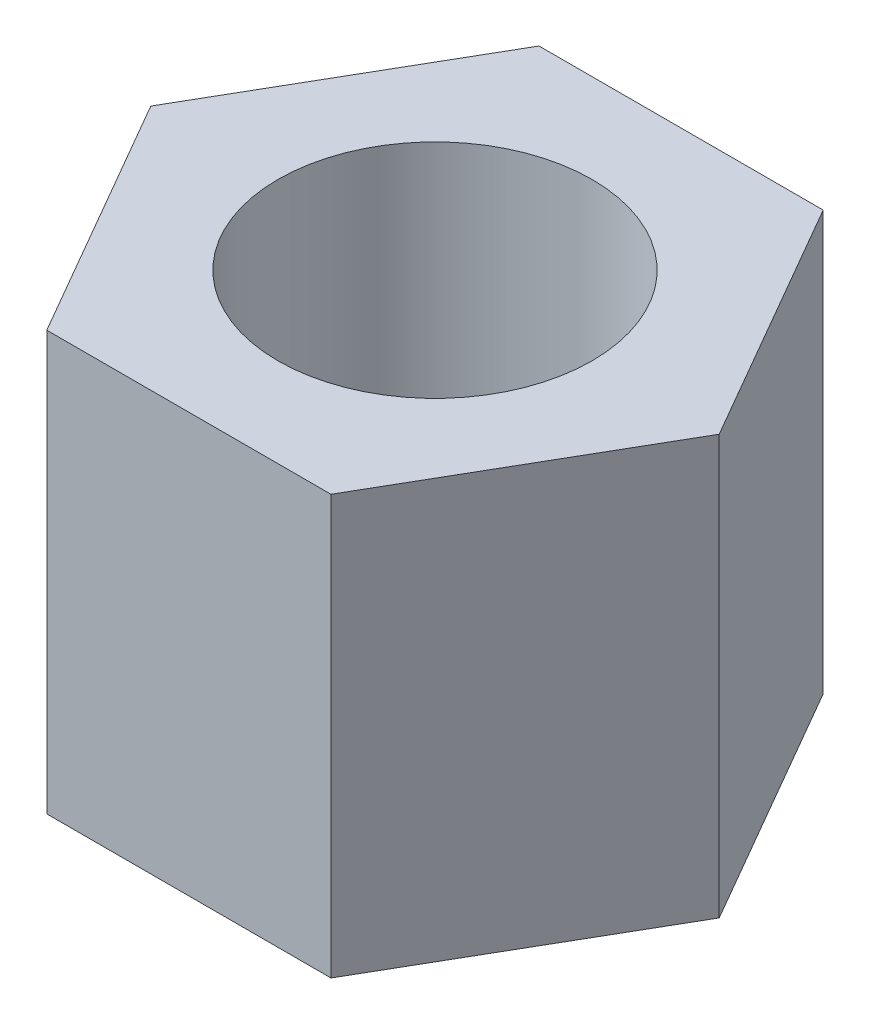
ISO-10303-21;
HEADER;
FILE_DESCRIPTION(('STEP AP214'),'2;1');
FILE_NAME('part.step','',(''),(''),'','','');
FILE_SCHEMA(('AUTOMOTIVE_DESIGN { 1 0 10303 214 1 1 1 1 }'));
ENDSEC;
DATA;
#1=APPLICATION_CONTEXT('core data for automotive mechanical design processes');
#2=APPLICATION_PROTOCOL_DEFINITION('international standard','automotive_design',2000,#1);
#3=PRODUCT_CONTEXT('',#1,'mechanical');
#4=PRODUCT('Part','Part','',(#3));
#5=PRODUCT_RELATED_PRODUCT_CATEGORY('part','',(#4));
#6=PRODUCT_DEFINITION_FORMATION('','',#4);
#7=PRODUCT_DEFINITION_CONTEXT('part definition',#1,'design');
#8=PRODUCT_DEFINITION('design','',#6,#7);
#9=PRODUCT_DEFINITION_SHAPE('','',#8);
#10=(LENGTH_UNIT() NAMED_UNIT(*) SI_UNIT(.MILLI.,.METRE.));
#11=(NAMED_UNIT(*) PLANE_ANGLE_UNIT() SI_UNIT($,.RADIAN.));
#12=(NAMED_UNIT(*) SI_UNIT($,.STERADIAN.) SOLID_ANGLE_UNIT());
#13=UNCERTAINTY_MEASURE_WITH_UNIT(LENGTH_MEASURE(1.E-05),#10,'distance_accuracy_value','');
#14=(GEOMETRIC_REPRESENTATION_CONTEXT(3) GLOBAL_UNCERTAINTY_ASSIGNED_CONTEXT((#13)) GLOBAL_UNIT_ASSIGNED_CONTEXT((#10,
#11,#12)) REPRESENTATION_CONTEXT('',''));
#15=CARTESIAN_POINT('',(0.,0.,0.));
#16=DIRECTION('',(0.,0.,1.));
#17=DIRECTION('',(1.,0.,0.));
#18=AXIS2_PLACEMENT_3D('',#15,#16,#17);
#19=CARTESIAN_POINT('',(1.35677313259565,4.,2.34999999999999));
#20=DIRECTION('',(-0.866025403784441,0.,-0.499999999999995));
#21=DIRECTION('',(-0.499999999999995,0.,0.866025403784442));
#22=AXIS2_PLACEMENT_3D('',#19,#20,#21);
#23=PLANE('',#22);
#24=DIRECTION('',(0.499999999999995,0.,-0.866025403784441));
#25=VECTOR('',#24,1.);
#26=CARTESIAN_POINT('',(1.35677313259565,0.,2.34999999999999));
#27=LINE('',#26,#25);
#28=CARTESIAN_POINT('',(1.35677313259565,0.,2.34999999999999));
#29=VERTEX_POINT('',#28);
#30=CARTESIAN_POINT('',(2.71354626519124,0.,0.));
#31=VERTEX_POINT('',#30);
#32=EDGE_CURVE('E118',#29,#31,#27,.T.);
#33=ORIENTED_EDGE('',*,*,#32,.T.);
#34=DIRECTION('',(0.,-1.,0.));
#35=VECTOR('',#34,1.);
#36=CARTESIAN_POINT('',(2.71354626519124,4.,0.));
#37=LINE('',#36,#35);
#38=CARTESIAN_POINT('',(2.71354626519124,4.,0.));
#39=VERTEX_POINT('',#38);
#40=EDGE_CURVE('E11',#39,#31,#37,.T.);
#41=ORIENTED_EDGE('',*,*,#40,.F.);
#42=DIRECTION('',(0.499999999999995,0.,-0.866025403784441));
#43=VECTOR('',#42,1.);
#44=CARTESIAN_POINT('',(1.35677313259565,4.,2.34999999999999));
#45=LINE('',#44,#43);
#46=CARTESIAN_POINT('',(1.35677313259565,4.,2.34999999999999));
#47=VERTEX_POINT('',#46);
#48=EDGE_CURVE('E129',#47,#39,#45,.T.);
#49=ORIENTED_EDGE('',*,*,#48,.F.);
#50=DIRECTION('',(0.,-1.,0.));
#51=VECTOR('',#50,1.);
#52=CARTESIAN_POINT('',(1.35677313259565,4.,2.34999999999999));
#53=LINE('',#52,#51);
#54=EDGE_CURVE('E114',#47,#29,#53,.T.);
#55=ORIENTED_EDGE('',*,*,#54,.T.);
#56=EDGE_LOOP('',(#33,#41,#49,#55));
#57=FACE_BOUND('',#56,.T.);
#58=ADVANCED_FACE('F34',(#57),#23,.F.);
#59=CARTESIAN_POINT('',(2.71354626519124,4.,0.));
#60=DIRECTION('',(-0.866025403784438,0.,0.500000000000001));
#61=DIRECTION('',(0.500000000000001,0.,0.866025403784438));
#62=AXIS2_PLACEMENT_3D('',#59,#60,#61);
#63=PLANE('',#62);
#64=DIRECTION('',(-0.500000000000001,0.,-0.866025403784438));
#65=VECTOR('',#64,1.);
#66=CARTESIAN_POINT('',(2.71354626519124,0.,0.));
#67=LINE('',#66,#65);
#68=CARTESIAN_POINT('',(1.35677313259562,0.,-2.35));
#69=VERTEX_POINT('',#68);
#70=EDGE_CURVE('E121',#31,#69,#67,.T.);
#71=ORIENTED_EDGE('',*,*,#70,.T.);
#72=DIRECTION('',(0.,-1.,0.));
#73=VECTOR('',#72,1.);
#74=CARTESIAN_POINT('',(1.35677313259562,4.,-2.35));
#75=LINE('',#74,#73);
#76=CARTESIAN_POINT('',(1.35677313259562,4.,-2.35));
#77=VERTEX_POINT('',#76);
#78=EDGE_CURVE('E42',#77,#69,#75,.T.);
#79=ORIENTED_EDGE('',*,*,#78,.F.);
#80=DIRECTION('',(-0.500000000000001,0.,-0.866025403784438));
#81=VECTOR('',#80,1.);
#82=CARTESIAN_POINT('',(2.71354626519124,4.,0.));
#83=LINE('',#82,#81);
#84=EDGE_CURVE('E87',#39,#77,#83,.T.);
#85=ORIENTED_EDGE('',*,*,#84,.F.);
#86=ORIENTED_EDGE('',*,*,#40,.T.);
#87=EDGE_LOOP('',(#71,#79,#85,#86));
#88=FACE_BOUND('',#87,.T.);
#89=ADVANCED_FACE('F154',(#88),#63,.F.);
#90=CARTESIAN_POINT('',(1.35677313259562,4.,-2.35));
#91=DIRECTION('',(0.,0.,1.));
#92=DIRECTION('',(1.,0.,0.));
#93=AXIS2_PLACEMENT_3D('',#90,#91,#92);
#94=PLANE('',#93);
#95=DIRECTION('',(-1.,0.,0.));
#96=VECTOR('',#95,1.);
#97=CARTESIAN_POINT('',(1.35677313259562,0.,-2.35));
#98=LINE('',#97,#96);
#99=CARTESIAN_POINT('',(-1.35677313259563,0.,-2.35));
#100=VERTEX_POINT('',#99);
#101=EDGE_CURVE('E124',#69,#100,#98,.T.);
#102=ORIENTED_EDGE('',*,*,#101,.T.);
#103=DIRECTION('',(0.,-1.,0.));
#104=VECTOR('',#103,1.);
#105=CARTESIAN_POINT('',(-1.35677313259563,4.,-2.35));
#106=LINE('',#105,#104);
#107=CARTESIAN_POINT('',(-1.35677313259563,4.,-2.35));
#108=VERTEX_POINT('',#107);
#109=EDGE_CURVE('E109',#108,#100,#106,.T.);
#110=ORIENTED_EDGE('',*,*,#109,.F.);
#111=DIRECTION('',(-1.,0.,0.));
#112=VECTOR('',#111,1.);
#113=CARTESIAN_POINT('',(1.35677313259562,4.,-2.35));
#114=LINE('',#113,#112);
#115=EDGE_CURVE('E100',#77,#108,#114,.T.);
#116=ORIENTED_EDGE('',*,*,#115,.F.);
#117=ORIENTED_EDGE('',*,*,#78,.T.);
#118=EDGE_LOOP('',(#102,#110,#116,#117));
#119=FACE_BOUND('',#118,.T.);
#120=ADVANCED_FACE('F135',(#119),#94,.F.);
#121=CARTESIAN_POINT('',(-1.35677313259563,4.,-2.35));
#122=DIRECTION('',(0.866025403784442,0.,0.499999999999995));
#123=DIRECTION('',(0.499999999999995,0.,-0.866025403784442));
#124=AXIS2_PLACEMENT_3D('',#121,#122,#123);
#125=PLANE('',#124);
#126=DIRECTION('',(-0.499999999999995,0.,0.866025403784441));
#127=VECTOR('',#126,1.);
#128=CARTESIAN_POINT('',(-1.35677313259563,0.,-2.35));
#129=LINE('',#128,#127);
#130=CARTESIAN_POINT('',(-2.71354626519124,0.,0.));
#131=VERTEX_POINT('',#130);
#132=EDGE_CURVE('E108',#100,#131,#129,.T.);
#133=ORIENTED_EDGE('',*,*,#132,.T.);
#134=DIRECTION('',(0.,-1.,0.));
#135=VECTOR('',#134,1.);
#136=CARTESIAN_POINT('',(-2.71354626519124,4.,0.));
#137=LINE('',#136,#135);
#138=CARTESIAN_POINT('',(-2.71354626519124,4.,0.));
#139=VERTEX_POINT('',#138);
#140=EDGE_CURVE('E105',#139,#131,#137,.T.);
#141=ORIENTED_EDGE('',*,*,#140,.F.);
#142=DIRECTION('',(-0.499999999999995,0.,0.866025403784441));
#143=VECTOR('',#142,1.);
#144=CARTESIAN_POINT('',(-1.35677313259563,4.,-2.35));
#145=LINE('',#144,#143);
#146=EDGE_CURVE('E94',#108,#139,#145,.T.);
#147=ORIENTED_EDGE('',*,*,#146,.F.);
#148=ORIENTED_EDGE('',*,*,#109,.T.);
#149=EDGE_LOOP('',(#133,#141,#147,#148));
#150=FACE_BOUND('',#149,.T.);
#151=ADVANCED_FACE('F106',(#150),#125,.F.);
#152=CARTESIAN_POINT('',(-2.71354626519124,4.,0.));
#153=DIRECTION('',(0.866025403784435,0.,-0.500000000000007));
#154=DIRECTION('',(-0.500000000000007,0.,-0.866025403784435));
#155=AXIS2_PLACEMENT_3D('',#152,#153,#154);
#156=PLANE('',#155);
#157=DIRECTION('',(0.500000000000007,0.,0.866025403784435));
#158=VECTOR('',#157,1.);
#159=CARTESIAN_POINT('',(-2.71354626519124,0.,0.));
#160=LINE('',#159,#158);
#161=CARTESIAN_POINT('',(-1.3567731325956,0.,2.35000000000001));
#162=VERTEX_POINT('',#161);
#163=EDGE_CURVE('E73',#131,#162,#160,.T.);
#164=ORIENTED_EDGE('',*,*,#163,.T.);
#165=DIRECTION('',(0.,-1.,0.));
#166=VECTOR('',#165,1.);
#167=CARTESIAN_POINT('',(-1.3567731325956,4.,2.35000000000001));
#168=LINE('',#167,#166);
#169=CARTESIAN_POINT('',(-1.3567731325956,4.,2.35000000000001));
#170=VERTEX_POINT('',#169);
#171=EDGE_CURVE('E110',#170,#162,#168,.T.);
#172=ORIENTED_EDGE('',*,*,#171,.F.);
#173=DIRECTION('',(0.500000000000007,0.,0.866025403784435));
#174=VECTOR('',#173,1.);
#175=CARTESIAN_POINT('',(-2.71354626519124,4.,0.));
#176=LINE('',#175,#174);
#177=EDGE_CURVE('E98',#139,#170,#176,.T.);
#178=ORIENTED_EDGE('',*,*,#177,.F.);
#179=ORIENTED_EDGE('',*,*,#140,.T.);
#180=EDGE_LOOP('',(#164,#172,#178,#179));
#181=FACE_BOUND('',#180,.T.);
#182=ADVANCED_FACE('F112',(#181),#156,.F.);
#183=CARTESIAN_POINT('',(-1.3567731325956,4.,2.35000000000001));
#184=DIRECTION('',(0.,0.,-1.));
#185=DIRECTION('',(-1.,0.,0.));
#186=AXIS2_PLACEMENT_3D('',#183,#184,#185);
#187=PLANE('',#186);
#188=DIRECTION('',(1.,0.,0.));
#189=VECTOR('',#188,1.);
#190=CARTESIAN_POINT('',(-1.3567731325956,0.,2.35000000000001));
#191=LINE('',#190,#189);
#192=EDGE_CURVE('E79',#162,#29,#191,.T.);
#193=ORIENTED_EDGE('',*,*,#192,.T.);
#194=ORIENTED_EDGE('',*,*,#54,.F.);
#195=DIRECTION('',(1.,0.,0.));
#196=VECTOR('',#195,1.);
#197=CARTESIAN_POINT('',(-1.3567731325956,4.,2.35000000000001));
#198=LINE('',#197,#196);
#199=EDGE_CURVE('E50',#170,#47,#198,.T.);
#200=ORIENTED_EDGE('',*,*,#199,.F.);
#201=ORIENTED_EDGE('',*,*,#171,.T.);
#202=EDGE_LOOP('',(#193,#194,#200,#201));
#203=FACE_BOUND('',#202,.T.);
#204=ADVANCED_FACE('F142',(#203),#187,.F.);
#205=CARTESIAN_POINT('',(0.,4.,0.));
#206=DIRECTION('',(0.,1.,0.));
#207=DIRECTION('',(0.,0.,1.));
#208=AXIS2_PLACEMENT_3D('',#205,#206,#207);
#209=PLANE('',#208);
#210=CARTESIAN_POINT('',(0.,4.,0.));
#211=DIRECTION('',(0.,1.,0.));
#212=DIRECTION('',(0.,0.,1.));
#213=AXIS2_PLACEMENT_3D('',#210,#211,#212);
#214=CIRCLE('',#213,1.5);
#215=CARTESIAN_POINT('',(0.,4.,1.5));
#216=VERTEX_POINT('',#215);
#217=EDGE_CURVE('E209',#216,#216,#214,.T.);
#218=ORIENTED_EDGE('',*,*,#217,.F.);
#219=EDGE_LOOP('',(#218));
#220=FACE_BOUND('',#219,.T.);
#221=ORIENTED_EDGE('',*,*,#48,.T.);
#222=ORIENTED_EDGE('',*,*,#84,.T.);
#223=ORIENTED_EDGE('',*,*,#115,.T.);
#224=ORIENTED_EDGE('',*,*,#146,.T.);
#225=ORIENTED_EDGE('',*,*,#177,.T.);
#226=ORIENTED_EDGE('',*,*,#199,.T.);
#227=EDGE_LOOP('',(#221,#222,#223,#224,#225,#226));
#228=FACE_BOUND('',#227,.T.);
#229=ADVANCED_FACE('F96',(#220,#228),#209,.T.);
#230=CARTESIAN_POINT('',(0.,0.,0.));
#231=DIRECTION('',(0.,1.,0.));
#232=DIRECTION('',(0.,0.,1.));
#233=AXIS2_PLACEMENT_3D('',#230,#231,#232);
#234=PLANE('',#233);
#235=CARTESIAN_POINT('',(0.,0.,0.));
#236=DIRECTION('',(0.,1.,0.));
#237=DIRECTION('',(0.,0.,1.));
#238=AXIS2_PLACEMENT_3D('',#235,#236,#237);
#239=CIRCLE('',#238,1.5);
#240=CARTESIAN_POINT('',(0.,0.,1.5));
#241=VERTEX_POINT('',#240);
#242=EDGE_CURVE('E122',#241,#241,#239,.T.);
#243=ORIENTED_EDGE('',*,*,#242,.T.);
#244=EDGE_LOOP('',(#243));
#245=FACE_BOUND('',#244,.T.);
#246=ORIENTED_EDGE('',*,*,#32,.F.);
#247=ORIENTED_EDGE('',*,*,#192,.F.);
#248=ORIENTED_EDGE('',*,*,#163,.F.);
#249=ORIENTED_EDGE('',*,*,#132,.F.);
#250=ORIENTED_EDGE('',*,*,#101,.F.);
#251=ORIENTED_EDGE('',*,*,#70,.F.);
#252=EDGE_LOOP('',(#246,#247,#248,#249,#250,#251));
#253=FACE_BOUND('',#252,.T.);
#254=ADVANCED_FACE('F138',(#245,#253),#234,.F.);
#255=CARTESIAN_POINT('',(0.,0.,0.));
#256=DIRECTION('',(0.,1.,0.));
#257=DIRECTION('',(0.,0.,1.));
#258=AXIS2_PLACEMENT_3D('',#255,#256,#257);
#259=CYLINDRICAL_SURFACE('',#258,1.5);
#260=ORIENTED_EDGE('',*,*,#242,.F.);
#261=EDGE_LOOP('',(#260));
#262=FACE_BOUND('',#261,.T.);
#263=ORIENTED_EDGE('',*,*,#217,.T.);
#264=EDGE_LOOP('',(#263));
#265=FACE_BOUND('',#264,.T.);
#266=ADVANCED_FACE('F191',(#262,#265),#259,.F.);
#267=CLOSED_SHELL('',(#58,#89,#120,#151,#182,#204,#229,#254,#266));
#268=MANIFOLD_SOLID_BREP('B2',#267);
#269=ADVANCED_BREP_SHAPE_REPRESENTATION('',(#18,#268),#14);
#270=SHAPE_DEFINITION_REPRESENTATION(#9,#269);
ENDSEC;
END-ISO-10303-21;
